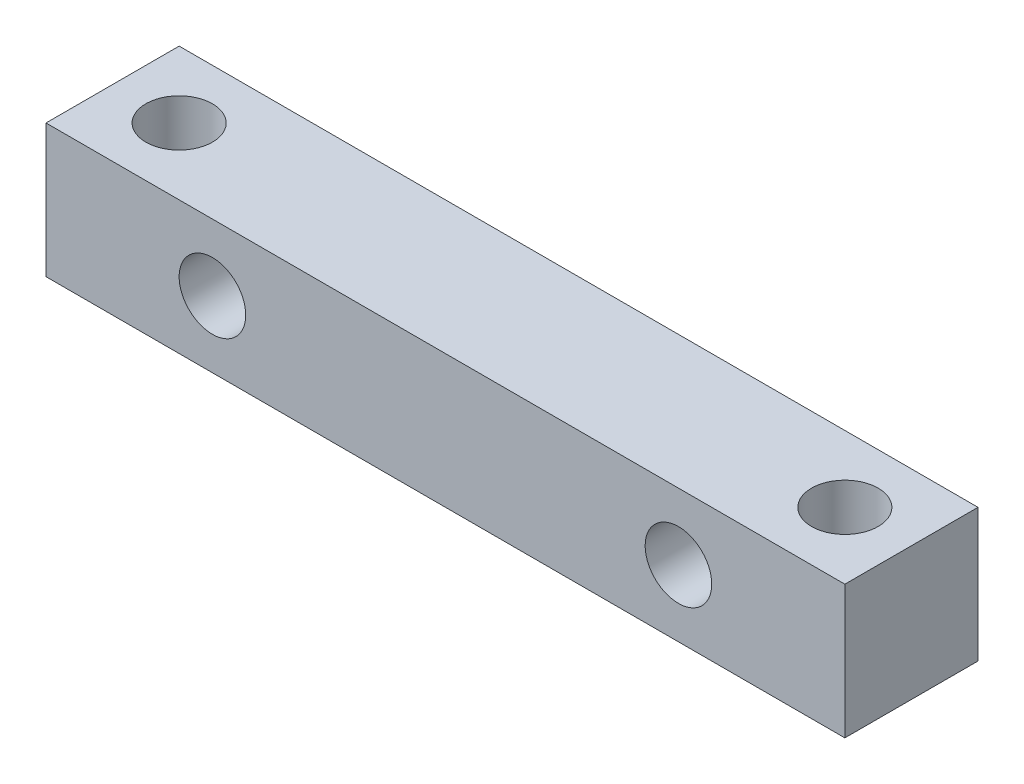
ISO-10303-21;
HEADER;
FILE_DESCRIPTION(('STEP AP214'),'2;1');
FILE_NAME('part.step','',(''),(''),'','','');
FILE_SCHEMA(('AUTOMOTIVE_DESIGN { 1 0 10303 214 1 1 1 1 }'));
ENDSEC;
DATA;
#1=APPLICATION_CONTEXT('core data for automotive mechanical design processes');
#2=APPLICATION_PROTOCOL_DEFINITION('international standard','automotive_design',2000,#1);
#3=PRODUCT_CONTEXT('',#1,'mechanical');
#4=PRODUCT('Part','Part','',(#3));
#5=PRODUCT_RELATED_PRODUCT_CATEGORY('part','',(#4));
#6=PRODUCT_DEFINITION_FORMATION('','',#4);
#7=PRODUCT_DEFINITION_CONTEXT('part definition',#1,'design');
#8=PRODUCT_DEFINITION('design','',#6,#7);
#9=PRODUCT_DEFINITION_SHAPE('','',#8);
#10=(LENGTH_UNIT() NAMED_UNIT(*) SI_UNIT(.MILLI.,.METRE.));
#11=(NAMED_UNIT(*) PLANE_ANGLE_UNIT() SI_UNIT($,.RADIAN.));
#12=(NAMED_UNIT(*) SI_UNIT($,.STERADIAN.) SOLID_ANGLE_UNIT());
#13=UNCERTAINTY_MEASURE_WITH_UNIT(LENGTH_MEASURE(1.E-05),#10,'distance_accuracy_value','');
#14=(GEOMETRIC_REPRESENTATION_CONTEXT(3) GLOBAL_UNCERTAINTY_ASSIGNED_CONTEXT((#13)) GLOBAL_UNIT_ASSIGNED_CONTEXT((#10,
#11,#12)) REPRESENTATION_CONTEXT('',''));
#15=CARTESIAN_POINT('',(0.,0.,0.));
#16=DIRECTION('',(0.,0.,1.));
#17=DIRECTION('',(1.,0.,0.));
#18=AXIS2_PLACEMENT_3D('',#15,#16,#17);
#19=CARTESIAN_POINT('',(-18.,6.,3.));
#20=DIRECTION('',(0.,0.,-1.));
#21=DIRECTION('',(-1.,0.,0.));
#22=AXIS2_PLACEMENT_3D('',#19,#20,#21);
#23=PLANE('',#22);
#24=DIRECTION('',(1.,0.,0.));
#25=VECTOR('',#24,1.);
#26=CARTESIAN_POINT('',(-18.,0.,3.));
#27=LINE('',#26,#25);
#28=CARTESIAN_POINT('',(-18.,0.,3.));
#29=VERTEX_POINT('',#28);
#30=CARTESIAN_POINT('',(18.,0.,3.));
#31=VERTEX_POINT('',#30);
#32=EDGE_CURVE('E91',#29,#31,#27,.T.);
#33=ORIENTED_EDGE('',*,*,#32,.T.);
#34=DIRECTION('',(0.,-1.,0.));
#35=VECTOR('',#34,1.);
#36=CARTESIAN_POINT('',(18.,6.,3.));
#37=LINE('',#36,#35);
#38=CARTESIAN_POINT('',(18.,6.,3.));
#39=VERTEX_POINT('',#38);
#40=EDGE_CURVE('E42',#39,#31,#37,.T.);
#41=ORIENTED_EDGE('',*,*,#40,.F.);
#42=DIRECTION('',(1.,0.,0.));
#43=VECTOR('',#42,1.);
#44=CARTESIAN_POINT('',(-18.,6.,3.));
#45=LINE('',#44,#43);
#46=CARTESIAN_POINT('',(-18.,6.,3.));
#47=VERTEX_POINT('',#46);
#48=EDGE_CURVE('E81',#47,#39,#45,.T.);
#49=ORIENTED_EDGE('',*,*,#48,.F.);
#50=DIRECTION('',(0.,-1.,0.));
#51=VECTOR('',#50,1.);
#52=CARTESIAN_POINT('',(-18.,6.,3.));
#53=LINE('',#52,#51);
#54=EDGE_CURVE('E11',#47,#29,#53,.T.);
#55=ORIENTED_EDGE('',*,*,#54,.T.);
#56=EDGE_LOOP('',(#33,#41,#49,#55));
#57=FACE_BOUND('',#56,.T.);
#58=CARTESIAN_POINT('',(-10.5,3.,3.));
#59=DIRECTION('',(0.,0.,1.));
#60=DIRECTION('',(1.,0.,0.));
#61=AXIS2_PLACEMENT_3D('',#58,#59,#60);
#62=CIRCLE('',#61,1.5);
#63=CARTESIAN_POINT('',(-9.,3.,3.));
#64=VERTEX_POINT('',#63);
#65=EDGE_CURVE('E122',#64,#64,#62,.T.);
#66=ORIENTED_EDGE('',*,*,#65,.F.);
#67=EDGE_LOOP('',(#66));
#68=FACE_BOUND('',#67,.T.);
#69=CARTESIAN_POINT('',(10.5,3.,3.));
#70=DIRECTION('',(0.,0.,-1.));
#71=DIRECTION('',(-1.,0.,0.));
#72=AXIS2_PLACEMENT_3D('',#69,#70,#71);
#73=CIRCLE('',#72,1.5);
#74=CARTESIAN_POINT('',(9.,3.,3.));
#75=VERTEX_POINT('',#74);
#76=EDGE_CURVE('E128',#75,#75,#73,.T.);
#77=ORIENTED_EDGE('',*,*,#76,.T.);
#78=EDGE_LOOP('',(#77));
#79=FACE_BOUND('',#78,.T.);
#80=ADVANCED_FACE('F32',(#57,#68,#79),#23,.F.);
#81=CARTESIAN_POINT('',(-18.,6.,-3.));
#82=DIRECTION('',(0.,0.,1.));
#83=DIRECTION('',(1.,0.,0.));
#84=AXIS2_PLACEMENT_3D('',#81,#82,#83);
#85=PLANE('',#84);
#86=DIRECTION('',(-1.,0.,0.));
#87=VECTOR('',#86,1.);
#88=CARTESIAN_POINT('',(-18.,0.,-3.));
#89=LINE('',#88,#87);
#90=CARTESIAN_POINT('',(18.,0.,-3.));
#91=VERTEX_POINT('',#90);
#92=CARTESIAN_POINT('',(-18.,0.,-3.));
#93=VERTEX_POINT('',#92);
#94=EDGE_CURVE('E74',#91,#93,#89,.T.);
#95=ORIENTED_EDGE('',*,*,#94,.T.);
#96=DIRECTION('',(0.,-1.,0.));
#97=VECTOR('',#96,1.);
#98=CARTESIAN_POINT('',(-18.,6.,-3.));
#99=LINE('',#98,#97);
#100=CARTESIAN_POINT('',(-18.,6.,-3.));
#101=VERTEX_POINT('',#100);
#102=EDGE_CURVE('E96',#101,#93,#99,.T.);
#103=ORIENTED_EDGE('',*,*,#102,.F.);
#104=DIRECTION('',(-1.,0.,0.));
#105=VECTOR('',#104,1.);
#106=CARTESIAN_POINT('',(-18.,6.,-3.));
#107=LINE('',#106,#105);
#108=CARTESIAN_POINT('',(18.,6.,-3.));
#109=VERTEX_POINT('',#108);
#110=EDGE_CURVE('E51',#109,#101,#107,.T.);
#111=ORIENTED_EDGE('',*,*,#110,.F.);
#112=DIRECTION('',(0.,-1.,0.));
#113=VECTOR('',#112,1.);
#114=CARTESIAN_POINT('',(18.,6.,-3.));
#115=LINE('',#114,#113);
#116=EDGE_CURVE('E92',#109,#91,#115,.T.);
#117=ORIENTED_EDGE('',*,*,#116,.T.);
#118=EDGE_LOOP('',(#95,#103,#111,#117));
#119=FACE_BOUND('',#118,.T.);
#120=CARTESIAN_POINT('',(-10.5,3.,-3.));
#121=DIRECTION('',(0.,0.,1.));
#122=DIRECTION('',(1.,0.,0.));
#123=AXIS2_PLACEMENT_3D('',#120,#121,#122);
#124=CIRCLE('',#123,1.5);
#125=CARTESIAN_POINT('',(-9.,3.,-3.));
#126=VERTEX_POINT('',#125);
#127=EDGE_CURVE('E121',#126,#126,#124,.T.);
#128=ORIENTED_EDGE('',*,*,#127,.T.);
#129=EDGE_LOOP('',(#128));
#130=FACE_BOUND('',#129,.T.);
#131=CARTESIAN_POINT('',(10.5,3.,-3.));
#132=DIRECTION('',(0.,0.,-1.));
#133=DIRECTION('',(-1.,0.,0.));
#134=AXIS2_PLACEMENT_3D('',#131,#132,#133);
#135=CIRCLE('',#134,1.5);
#136=CARTESIAN_POINT('',(9.,3.,-3.));
#137=VERTEX_POINT('',#136);
#138=EDGE_CURVE('E125',#137,#137,#135,.T.);
#139=ORIENTED_EDGE('',*,*,#138,.F.);
#140=EDGE_LOOP('',(#139));
#141=FACE_BOUND('',#140,.T.);
#142=ADVANCED_FACE('F137',(#119,#130,#141),#85,.F.);
#143=CARTESIAN_POINT('',(0.,6.,0.));
#144=DIRECTION('',(0.,1.,0.));
#145=DIRECTION('',(0.,0.,1.));
#146=AXIS2_PLACEMENT_3D('',#143,#144,#145);
#147=PLANE('',#146);
#148=DIRECTION('',(0.,0.,1.));
#149=VECTOR('',#148,1.);
#150=CARTESIAN_POINT('',(-18.,6.,-3.));
#151=LINE('',#150,#149);
#152=EDGE_CURVE('E87',#101,#47,#151,.T.);
#153=ORIENTED_EDGE('',*,*,#152,.T.);
#154=ORIENTED_EDGE('',*,*,#48,.T.);
#155=DIRECTION('',(0.,0.,-1.));
#156=VECTOR('',#155,1.);
#157=CARTESIAN_POINT('',(18.,6.,-3.));
#158=LINE('',#157,#156);
#159=EDGE_CURVE('E85',#39,#109,#158,.T.);
#160=ORIENTED_EDGE('',*,*,#159,.T.);
#161=ORIENTED_EDGE('',*,*,#110,.T.);
#162=EDGE_LOOP('',(#153,#154,#160,#161));
#163=FACE_BOUND('',#162,.T.);
#164=CARTESIAN_POINT('',(-15.,6.,0.));
#165=DIRECTION('',(0.,1.,0.));
#166=DIRECTION('',(0.,0.,1.));
#167=AXIS2_PLACEMENT_3D('',#164,#165,#166);
#168=CIRCLE('',#167,1.5);
#169=CARTESIAN_POINT('',(-15.,6.,1.5));
#170=VERTEX_POINT('',#169);
#171=EDGE_CURVE('E109',#170,#170,#168,.T.);
#172=ORIENTED_EDGE('',*,*,#171,.F.);
#173=EDGE_LOOP('',(#172));
#174=FACE_BOUND('',#173,.T.);
#175=CARTESIAN_POINT('',(15.,6.,0.));
#176=DIRECTION('',(0.,-1.,0.));
#177=DIRECTION('',(0.,0.,1.));
#178=AXIS2_PLACEMENT_3D('',#175,#176,#177);
#179=CIRCLE('',#178,1.5);
#180=CARTESIAN_POINT('',(15.,6.,1.5));
#181=VERTEX_POINT('',#180);
#182=EDGE_CURVE('E117',#181,#181,#179,.T.);
#183=ORIENTED_EDGE('',*,*,#182,.T.);
#184=EDGE_LOOP('',(#183));
#185=FACE_BOUND('',#184,.T.);
#186=ADVANCED_FACE('F82',(#163,#174,#185),#147,.T.);
#187=CARTESIAN_POINT('',(0.,0.,0.));
#188=DIRECTION('',(0.,1.,0.));
#189=DIRECTION('',(0.,0.,1.));
#190=AXIS2_PLACEMENT_3D('',#187,#188,#189);
#191=PLANE('',#190);
#192=DIRECTION('',(0.,0.,1.));
#193=VECTOR('',#192,1.);
#194=CARTESIAN_POINT('',(-18.,0.,-3.));
#195=LINE('',#194,#193);
#196=EDGE_CURVE('E100',#93,#29,#195,.T.);
#197=ORIENTED_EDGE('',*,*,#196,.F.);
#198=ORIENTED_EDGE('',*,*,#94,.F.);
#199=DIRECTION('',(0.,0.,-1.));
#200=VECTOR('',#199,1.);
#201=CARTESIAN_POINT('',(18.,0.,-3.));
#202=LINE('',#201,#200);
#203=EDGE_CURVE('E68',#31,#91,#202,.T.);
#204=ORIENTED_EDGE('',*,*,#203,.F.);
#205=ORIENTED_EDGE('',*,*,#32,.F.);
#206=EDGE_LOOP('',(#197,#198,#204,#205));
#207=FACE_BOUND('',#206,.T.);
#208=CARTESIAN_POINT('',(-15.,0.,0.));
#209=DIRECTION('',(0.,1.,0.));
#210=DIRECTION('',(0.,0.,1.));
#211=AXIS2_PLACEMENT_3D('',#208,#209,#210);
#212=CIRCLE('',#211,1.5);
#213=CARTESIAN_POINT('',(-15.,0.,1.5));
#214=VERTEX_POINT('',#213);
#215=EDGE_CURVE('E103',#214,#214,#212,.T.);
#216=ORIENTED_EDGE('',*,*,#215,.T.);
#217=EDGE_LOOP('',(#216));
#218=FACE_BOUND('',#217,.T.);
#219=CARTESIAN_POINT('',(15.,0.,0.));
#220=DIRECTION('',(0.,1.,0.));
#221=DIRECTION('',(0.,0.,1.));
#222=AXIS2_PLACEMENT_3D('',#219,#220,#221);
#223=CIRCLE('',#222,1.5);
#224=CARTESIAN_POINT('',(15.,0.,1.5));
#225=VERTEX_POINT('',#224);
#226=EDGE_CURVE('E36',#225,#225,#223,.F.);
#227=ORIENTED_EDGE('',*,*,#226,.F.);
#228=EDGE_LOOP('',(#227));
#229=FACE_BOUND('',#228,.T.);
#230=ADVANCED_FACE('F144',(#207,#218,#229),#191,.F.);
#231=CARTESIAN_POINT('',(-18.,6.,-3.));
#232=DIRECTION('',(1.,0.,0.));
#233=DIRECTION('',(0.,0.,-1.));
#234=AXIS2_PLACEMENT_3D('',#231,#232,#233);
#235=PLANE('',#234);
#236=ORIENTED_EDGE('',*,*,#196,.T.);
#237=ORIENTED_EDGE('',*,*,#54,.F.);
#238=ORIENTED_EDGE('',*,*,#152,.F.);
#239=ORIENTED_EDGE('',*,*,#102,.T.);
#240=EDGE_LOOP('',(#236,#237,#238,#239));
#241=FACE_BOUND('',#240,.T.);
#242=ADVANCED_FACE('F34',(#241),#235,.F.);
#243=CARTESIAN_POINT('',(18.,6.,-3.));
#244=DIRECTION('',(-1.,0.,0.));
#245=DIRECTION('',(0.,0.,1.));
#246=AXIS2_PLACEMENT_3D('',#243,#244,#245);
#247=PLANE('',#246);
#248=ORIENTED_EDGE('',*,*,#203,.T.);
#249=ORIENTED_EDGE('',*,*,#116,.F.);
#250=ORIENTED_EDGE('',*,*,#159,.F.);
#251=ORIENTED_EDGE('',*,*,#40,.T.);
#252=EDGE_LOOP('',(#248,#249,#250,#251));
#253=FACE_BOUND('',#252,.T.);
#254=ADVANCED_FACE('F94',(#253),#247,.F.);
#255=CARTESIAN_POINT('',(-15.,-54.,0.));
#256=DIRECTION('',(0.,1.,0.));
#257=DIRECTION('',(0.,0.,1.));
#258=AXIS2_PLACEMENT_3D('',#255,#256,#257);
#259=CYLINDRICAL_SURFACE('',#258,1.5);
#260=ORIENTED_EDGE('',*,*,#171,.T.);
#261=EDGE_LOOP('',(#260));
#262=FACE_BOUND('',#261,.T.);
#263=ORIENTED_EDGE('',*,*,#215,.F.);
#264=EDGE_LOOP('',(#263));
#265=FACE_BOUND('',#264,.T.);
#266=ADVANCED_FACE('F150',(#262,#265),#259,.F.);
#267=CARTESIAN_POINT('',(15.,-54.,0.));
#268=DIRECTION('',(0.,1.,0.));
#269=DIRECTION('',(0.,0.,1.));
#270=AXIS2_PLACEMENT_3D('',#267,#268,#269);
#271=CYLINDRICAL_SURFACE('',#270,1.5);
#272=ORIENTED_EDGE('',*,*,#182,.F.);
#273=EDGE_LOOP('',(#272));
#274=FACE_BOUND('',#273,.T.);
#275=ORIENTED_EDGE('',*,*,#226,.T.);
#276=EDGE_LOOP('',(#275));
#277=FACE_BOUND('',#276,.T.);
#278=ADVANCED_FACE('F155',(#274,#277),#271,.F.);
#279=CARTESIAN_POINT('',(-10.5,3.,-3.));
#280=DIRECTION('',(0.,0.,1.));
#281=DIRECTION('',(1.,0.,0.));
#282=AXIS2_PLACEMENT_3D('',#279,#280,#281);
#283=CYLINDRICAL_SURFACE('',#282,1.5);
#284=ORIENTED_EDGE('',*,*,#127,.F.);
#285=EDGE_LOOP('',(#284));
#286=FACE_BOUND('',#285,.T.);
#287=ORIENTED_EDGE('',*,*,#65,.T.);
#288=EDGE_LOOP('',(#287));
#289=FACE_BOUND('',#288,.T.);
#290=ADVANCED_FACE('F167',(#286,#289),#283,.F.);
#291=CARTESIAN_POINT('',(10.5,3.,-3.));
#292=DIRECTION('',(0.,0.,1.));
#293=DIRECTION('',(1.,0.,0.));
#294=AXIS2_PLACEMENT_3D('',#291,#292,#293);
#295=CYLINDRICAL_SURFACE('',#294,1.5);
#296=ORIENTED_EDGE('',*,*,#138,.T.);
#297=EDGE_LOOP('',(#296));
#298=FACE_BOUND('',#297,.T.);
#299=ORIENTED_EDGE('',*,*,#76,.F.);
#300=EDGE_LOOP('',(#299));
#301=FACE_BOUND('',#300,.T.);
#302=ADVANCED_FACE('F134',(#298,#301),#295,.F.);
#303=CLOSED_SHELL('',(#80,#142,#186,#230,#242,#254,#266,#278,#290,#302));
#304=MANIFOLD_SOLID_BREP('B2',#303);
#305=ADVANCED_BREP_SHAPE_REPRESENTATION('',(#18,#304),#14);
#306=SHAPE_DEFINITION_REPRESENTATION(#9,#305);
ENDSEC;
END-ISO-10303-21;
